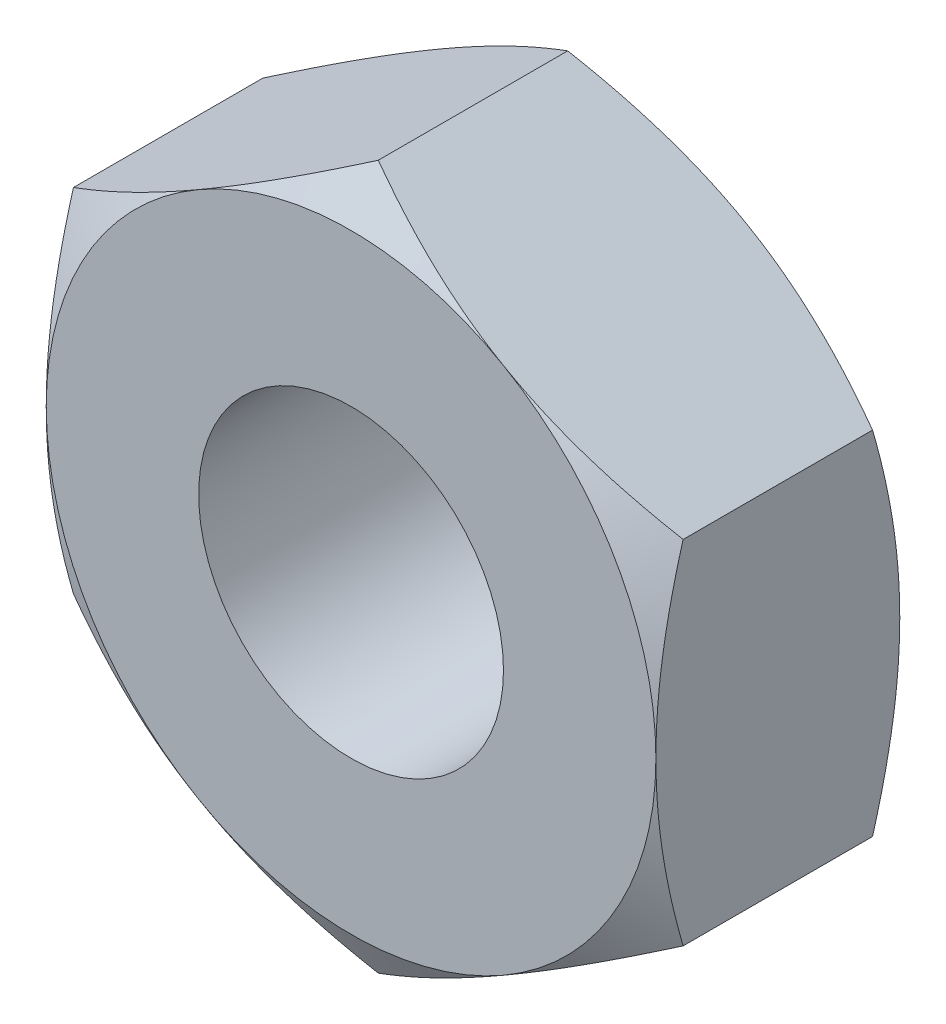
ISO-10303-21;
HEADER;
FILE_DESCRIPTION(('STEP AP214'),'2;1');
FILE_NAME('part.step','',(''),(''),'','','');
FILE_SCHEMA(('AUTOMOTIVE_DESIGN { 1 0 10303 214 1 1 1 1 }'));
ENDSEC;
DATA;
#1=APPLICATION_CONTEXT('core data for automotive mechanical design processes');
#2=APPLICATION_PROTOCOL_DEFINITION('international standard','automotive_design',2000,#1);
#3=PRODUCT_CONTEXT('',#1,'mechanical');
#4=PRODUCT('Part','Part','',(#3));
#5=PRODUCT_RELATED_PRODUCT_CATEGORY('part','',(#4));
#6=PRODUCT_DEFINITION_FORMATION('','',#4);
#7=PRODUCT_DEFINITION_CONTEXT('part definition',#1,'design');
#8=PRODUCT_DEFINITION('design','',#6,#7);
#9=PRODUCT_DEFINITION_SHAPE('','',#8);
#10=(LENGTH_UNIT() NAMED_UNIT(*) SI_UNIT(.MILLI.,.METRE.));
#11=(NAMED_UNIT(*) PLANE_ANGLE_UNIT() SI_UNIT($,.RADIAN.));
#12=(NAMED_UNIT(*) SI_UNIT($,.STERADIAN.) SOLID_ANGLE_UNIT());
#13=UNCERTAINTY_MEASURE_WITH_UNIT(LENGTH_MEASURE(1.E-05),#10,'distance_accuracy_value','');
#14=(GEOMETRIC_REPRESENTATION_CONTEXT(3) GLOBAL_UNCERTAINTY_ASSIGNED_CONTEXT((#13)) GLOBAL_UNIT_ASSIGNED_CONTEXT((#10,
#11,#12)) REPRESENTATION_CONTEXT('',''));
#15=CARTESIAN_POINT('',(0.,0.,0.));
#16=DIRECTION('',(0.,0.,1.));
#17=DIRECTION('',(1.,0.,0.));
#18=AXIS2_PLACEMENT_3D('',#15,#16,#17);
#19=CARTESIAN_POINT('',(0.,0.,-1.));
#20=DIRECTION('',(0.,0.,1.));
#21=DIRECTION('',(1.,0.,0.));
#22=AXIS2_PLACEMENT_3D('',#19,#20,#21);
#23=PLANE('',#22);
#24=CARTESIAN_POINT('',(0.,0.,-1.));
#25=DIRECTION('',(0.,0.,1.));
#26=DIRECTION('',(1.,0.,0.));
#27=AXIS2_PLACEMENT_3D('',#24,#25,#26);
#28=CIRCLE('',#27,1.25);
#29=CARTESIAN_POINT('',(1.25,0.,-1.));
#30=VERTEX_POINT('',#29);
#31=EDGE_CURVE('E250',#30,#30,#28,.T.);
#32=ORIENTED_EDGE('',*,*,#31,.T.);
#33=EDGE_LOOP('',(#32));
#34=FACE_BOUND('',#33,.T.);
#35=CARTESIAN_POINT('',(0.,0.,-1.));
#36=DIRECTION('',(0.,0.,1.));
#37=DIRECTION('',(1.,0.,0.));
#38=AXIS2_PLACEMENT_3D('',#35,#36,#37);
#39=CIRCLE('',#38,2.50000000000001);
#40=CARTESIAN_POINT('',(2.50000000000001,0.,-1.));
#41=VERTEX_POINT('',#40);
#42=CARTESIAN_POINT('',(1.25,2.1650635094611,-1.));
#43=VERTEX_POINT('',#42);
#44=EDGE_CURVE('E138',#41,#43,#39,.T.);
#45=ORIENTED_EDGE('',*,*,#44,.F.);
#46=CARTESIAN_POINT('',(0.,0.,-1.));
#47=DIRECTION('',(0.,0.,1.));
#48=DIRECTION('',(1.,0.,0.));
#49=AXIS2_PLACEMENT_3D('',#46,#47,#48);
#50=CIRCLE('',#49,2.50000000000001);
#51=CARTESIAN_POINT('',(1.25,-2.1650635094611,-1.));
#52=VERTEX_POINT('',#51);
#53=EDGE_CURVE('E12',#41,#52,#50,.F.);
#54=ORIENTED_EDGE('',*,*,#53,.T.);
#55=CARTESIAN_POINT('',(-1.25,-2.1650635094611,-1.));
#56=VERTEX_POINT('',#55);
#57=EDGE_CURVE('E46',#52,#56,#50,.F.);
#58=ORIENTED_EDGE('',*,*,#57,.T.);
#59=CARTESIAN_POINT('',(-2.50000000000001,0.,-1.));
#60=VERTEX_POINT('',#59);
#61=EDGE_CURVE('E427',#56,#60,#50,.F.);
#62=ORIENTED_EDGE('',*,*,#61,.T.);
#63=CARTESIAN_POINT('',(-1.25,2.1650635094611,-1.));
#64=VERTEX_POINT('',#63);
#65=EDGE_CURVE('E146',#60,#64,#50,.F.);
#66=ORIENTED_EDGE('',*,*,#65,.T.);
#67=EDGE_CURVE('E47',#64,#43,#50,.F.);
#68=ORIENTED_EDGE('',*,*,#67,.T.);
#69=EDGE_LOOP('',(#45,#54,#58,#62,#66,#68));
#70=FACE_BOUND('',#69,.T.);
#71=ADVANCED_FACE('F37',(#34,#70),#23,.F.);
#72=CARTESIAN_POINT('',(0.,0.,1.));
#73=DIRECTION('',(0.,0.,1.));
#74=DIRECTION('',(1.,0.,0.));
#75=AXIS2_PLACEMENT_3D('',#72,#73,#74);
#76=PLANE('',#75);
#77=CARTESIAN_POINT('',(0.,0.,1.));
#78=DIRECTION('',(0.,0.,1.));
#79=DIRECTION('',(1.,0.,0.));
#80=AXIS2_PLACEMENT_3D('',#77,#78,#79);
#81=CIRCLE('',#80,1.25);
#82=CARTESIAN_POINT('',(1.25,0.,1.));
#83=VERTEX_POINT('',#82);
#84=EDGE_CURVE('E253',#83,#83,#81,.T.);
#85=ORIENTED_EDGE('',*,*,#84,.F.);
#86=EDGE_LOOP('',(#85));
#87=FACE_BOUND('',#86,.T.);
#88=CARTESIAN_POINT('',(0.,0.,1.));
#89=DIRECTION('',(0.,0.,1.));
#90=DIRECTION('',(1.,0.,0.));
#91=AXIS2_PLACEMENT_3D('',#88,#89,#90);
#92=CIRCLE('',#91,2.50000000000001);
#93=CARTESIAN_POINT('',(1.25,-2.16506350946109,1.));
#94=VERTEX_POINT('',#93);
#95=CARTESIAN_POINT('',(2.49999999999999,0.,1.));
#96=VERTEX_POINT('',#95);
#97=EDGE_CURVE('E152',#94,#96,#92,.T.);
#98=ORIENTED_EDGE('',*,*,#97,.T.);
#99=CARTESIAN_POINT('',(1.25,2.1650635094611,1.));
#100=VERTEX_POINT('',#99);
#101=EDGE_CURVE('E156',#96,#100,#92,.T.);
#102=ORIENTED_EDGE('',*,*,#101,.T.);
#103=CARTESIAN_POINT('',(-1.25,2.1650635094611,1.));
#104=VERTEX_POINT('',#103);
#105=EDGE_CURVE('E301',#100,#104,#92,.T.);
#106=ORIENTED_EDGE('',*,*,#105,.T.);
#107=CARTESIAN_POINT('',(-2.5,0.,1.));
#108=VERTEX_POINT('',#107);
#109=EDGE_CURVE('E305',#104,#108,#92,.T.);
#110=ORIENTED_EDGE('',*,*,#109,.T.);
#111=CARTESIAN_POINT('',(-1.25,-2.16506350946109,1.));
#112=VERTEX_POINT('',#111);
#113=EDGE_CURVE('E307',#108,#112,#92,.T.);
#114=ORIENTED_EDGE('',*,*,#113,.T.);
#115=EDGE_CURVE('E154',#112,#94,#92,.T.);
#116=ORIENTED_EDGE('',*,*,#115,.T.);
#117=EDGE_LOOP('',(#98,#102,#106,#110,#114,#116));
#118=FACE_BOUND('',#117,.T.);
#119=ADVANCED_FACE('F282',(#87,#118),#76,.T.);
#120=CARTESIAN_POINT('',(2.49999999999999,1.44337567297407,1.));
#121=DIRECTION('',(-0.499999999999999,-0.866025403784439,0.));
#122=DIRECTION('',(0.866025403784439,-0.499999999999999,0.));
#123=AXIS2_PLACEMENT_3D('',#120,#121,#122);
#124=PLANE('',#123);
#125=DIRECTION('',(0.,0.,-1.));
#126=VECTOR('',#125,1.);
#127=CARTESIAN_POINT('',(2.49999999999999,1.44337567297407,1.));
#128=LINE('',#127,#126);
#129=CARTESIAN_POINT('',(2.49999999999999,1.44337567297407,0.776709006307406));
#130=VERTEX_POINT('',#129);
#131=CARTESIAN_POINT('',(2.49999999999999,1.44337567297407,-0.776709006307406));
#132=VERTEX_POINT('',#131);
#133=EDGE_CURVE('E151',#130,#132,#128,.T.);
#134=ORIENTED_EDGE('',*,*,#133,.T.);
#135=CARTESIAN_POINT('',(2.50019999999999,1.44326020292023,-0.776642335640899));
#136=CARTESIAN_POINT('',(2.39033676526512,1.50668977106846,-0.813278379892381));
#137=CARTESIAN_POINT('',(2.27952520010347,1.57066685804386,-0.84659778103495));
#138=CARTESIAN_POINT('',(2.05598316653394,1.69972891130042,-0.904757714442148));
#139=CARTESIAN_POINT('',(1.9432487254716,1.7648161711947,-0.929577670852267));
#140=CARTESIAN_POINT('',(1.71917700612472,1.89418403867741,-0.968214348558953));
#141=CARTESIAN_POINT('',(1.60787420823261,1.95844473900197,-0.982288203814366));
#142=CARTESIAN_POINT('',(1.38474477253166,2.08726857876805,-0.999090847647254));
#143=CARTESIAN_POINT('',(1.27291894598576,2.15183124982667,-1.00183354879638));
#144=CARTESIAN_POINT('',(1.06395802444847,2.27247489412634,-0.99613423999195));
#145=CARTESIAN_POINT('',(0.966791682442262,2.3285739078398,-0.989091605618142));
#146=CARTESIAN_POINT('',(0.773092050288991,2.44040644260542,-0.966768580875061));
#147=CARTESIAN_POINT('',(0.676559430340262,2.4961395767184,-0.951480561559736));
#148=CARTESIAN_POINT('',(0.482460278259519,2.60820277442169,-0.913260906155583));
#149=CARTESIAN_POINT('',(0.384918318217855,2.66451865130903,-0.890167223874487));
#150=CARTESIAN_POINT('',(0.191289391923911,2.77631036402774,-0.837753343422091));
#151=CARTESIAN_POINT('',(0.0951999441138209,2.83178763258718,-0.808445464375456));
#152=CARTESIAN_POINT('',(-0.000200000000002555,2.88686681600197,-0.776642335640896));
#153=B_SPLINE_CURVE_WITH_KNOTS('',3,(#135,#136,#137,#138,#139,#140,#141,#142,#143,#144,#145,
#146,#147,#148,#149,#150,#151,#152),.UNSPECIFIED.,.F.,.F.,(4,2,2,2,2,2,2,2,4),(0.,
0.396285827362226,0.793524330152049,1.18093086852114,1.56786160134475,1.90479741793733,
2.24204551660462,2.58677531536755,2.93082800105255),.UNSPECIFIED.);
#154=EDGE_CURVE('E59',#132,#43,#153,.T.);
#155=ORIENTED_EDGE('',*,*,#154,.T.);
#156=CARTESIAN_POINT('',(0.,2.88675134594813,-0.776709006307403));
#157=VERTEX_POINT('',#156);
#158=EDGE_CURVE('E127',#43,#157,#153,.T.);
#159=ORIENTED_EDGE('',*,*,#158,.T.);
#160=DIRECTION('',(0.,0.,-1.));
#161=VECTOR('',#160,1.);
#162=CARTESIAN_POINT('',(0.,2.88675134594813,1.));
#163=LINE('',#162,#161);
#164=CARTESIAN_POINT('',(0.,2.88675134594813,0.776709006307403));
#165=VERTEX_POINT('',#164);
#166=EDGE_CURVE('E269',#165,#157,#163,.T.);
#167=ORIENTED_EDGE('',*,*,#166,.F.);
#168=CARTESIAN_POINT('',(2.50019999999999,1.44326020292023,0.776642335640899));
#169=CARTESIAN_POINT('',(2.39033676526512,1.50668977106846,0.813278379892381));
#170=CARTESIAN_POINT('',(2.27952520010347,1.57066685804386,0.84659778103495));
#171=CARTESIAN_POINT('',(2.05598316653394,1.69972891130042,0.904757714442148));
#172=CARTESIAN_POINT('',(1.9432487254716,1.7648161711947,0.929577670852267));
#173=CARTESIAN_POINT('',(1.71917700612472,1.89418403867741,0.968214348558953));
#174=CARTESIAN_POINT('',(1.60787420823261,1.95844473900197,0.982288203814366));
#175=CARTESIAN_POINT('',(1.38474477253166,2.08726857876805,0.999090847647254));
#176=CARTESIAN_POINT('',(1.27291894598576,2.15183124982667,1.00183354879638));
#177=CARTESIAN_POINT('',(1.06395802444847,2.27247489412634,0.99613423999195));
#178=CARTESIAN_POINT('',(0.966791682442262,2.3285739078398,0.989091605618142));
#179=CARTESIAN_POINT('',(0.773092050288991,2.44040644260542,0.966768580875061));
#180=CARTESIAN_POINT('',(0.676559430340262,2.4961395767184,0.951480561559736));
#181=CARTESIAN_POINT('',(0.482460278259519,2.60820277442169,0.913260906155583));
#182=CARTESIAN_POINT('',(0.384918318217855,2.66451865130903,0.890167223874487));
#183=CARTESIAN_POINT('',(0.191289391923911,2.77631036402774,0.837753343422091));
#184=CARTESIAN_POINT('',(0.0951999441138209,2.83178763258718,0.808445464375456));
#185=CARTESIAN_POINT('',(-0.000200000000002555,2.88686681600197,0.776642335640896));
#186=B_SPLINE_CURVE_WITH_KNOTS('',3,(#168,#169,#170,#171,#172,#173,#174,#175,#176,#177,#178,
#179,#180,#181,#182,#183,#184,#185),.UNSPECIFIED.,.F.,.F.,(4,2,2,2,2,2,2,2,4),(0.,
0.396285827362226,0.793524330152049,1.18093086852114,1.56786160134475,1.90479741793733,
2.24204551660462,2.58677531536755,2.93082800105255),.UNSPECIFIED.);
#187=EDGE_CURVE('E243',#100,#165,#186,.T.);
#188=ORIENTED_EDGE('',*,*,#187,.F.);
#189=EDGE_CURVE('E249',#130,#100,#186,.T.);
#190=ORIENTED_EDGE('',*,*,#189,.F.);
#191=EDGE_LOOP('',(#134,#155,#159,#167,#188,#190));
#192=FACE_BOUND('',#191,.T.);
#193=ADVANCED_FACE('F39',(#192),#124,.F.);
#194=CARTESIAN_POINT('',(0.,2.88675134594813,1.));
#195=DIRECTION('',(0.5,-0.866025403784439,0.));
#196=DIRECTION('',(0.866025403784439,0.5,0.));
#197=AXIS2_PLACEMENT_3D('',#194,#195,#196);
#198=PLANE('',#197);
#199=ORIENTED_EDGE('',*,*,#166,.T.);
#200=CARTESIAN_POINT('',(0.000199999999997342,2.88686681600197,-0.776642335640896));
#201=CARTESIAN_POINT('',(-0.109663234734874,2.82343724785375,-0.813278379892378));
#202=CARTESIAN_POINT('',(-0.220474799896528,2.75946016087834,-0.846597781034948));
#203=CARTESIAN_POINT('',(-0.444016833466053,2.63039810762178,-0.904757714442146));
#204=CARTESIAN_POINT('',(-0.556751274528391,2.5653108477275,-0.929577670852265));
#205=CARTESIAN_POINT('',(-0.780822993875272,2.43594298024479,-0.968214348558951));
#206=CARTESIAN_POINT('',(-0.89212579176738,2.37168227992023,-0.982288203814364));
#207=CARTESIAN_POINT('',(-1.11525522746834,2.24285844015415,-0.999090847647253));
#208=CARTESIAN_POINT('',(-1.22708105401423,2.17829576909553,-1.00183354879638));
#209=CARTESIAN_POINT('',(-1.43604197555152,2.05765212479586,-0.996134239991949));
#210=CARTESIAN_POINT('',(-1.53320831755773,2.0015531110824,-0.989091605618141));
#211=CARTESIAN_POINT('',(-1.72690794971101,1.88972057631678,-0.96676858087506));
#212=CARTESIAN_POINT('',(-1.82344056965974,1.8339874422038,-0.951480561559735));
#213=CARTESIAN_POINT('',(-2.01753972174048,1.7219242445005,-0.913260906155582));
#214=CARTESIAN_POINT('',(-2.11508168178214,1.66560836761316,-0.890167223874485));
#215=CARTESIAN_POINT('',(-2.30871060807609,1.55381665489446,-0.837753343422089));
#216=CARTESIAN_POINT('',(-2.40480005588618,1.49833938633502,-0.808445464375454));
#217=CARTESIAN_POINT('',(-2.5002,1.44326020292023,-0.776642335640894));
#218=B_SPLINE_CURVE_WITH_KNOTS('',3,(#200,#201,#202,#203,#204,#205,#206,#207,#208,#209,#210,
#211,#212,#213,#214,#215,#216,#217),.UNSPECIFIED.,.F.,.F.,(4,2,2,2,2,2,2,2,4),(0.,
0.396285827362227,0.793524330152051,1.18093086852114,1.56786160134475,1.90479741793733,
2.24204551660463,2.58677531536756,2.93082800105256),.UNSPECIFIED.);
#219=EDGE_CURVE('E132',#157,#64,#218,.T.);
#220=ORIENTED_EDGE('',*,*,#219,.T.);
#221=CARTESIAN_POINT('',(-2.5,1.44337567297407,-0.776709006307401));
#222=VERTEX_POINT('',#221);
#223=EDGE_CURVE('E163',#64,#222,#218,.T.);
#224=ORIENTED_EDGE('',*,*,#223,.T.);
#225=DIRECTION('',(0.,0.,-1.));
#226=VECTOR('',#225,1.);
#227=CARTESIAN_POINT('',(-2.5,1.44337567297407,1.));
#228=LINE('',#227,#226);
#229=CARTESIAN_POINT('',(-2.5,1.44337567297407,0.776709006307401));
#230=VERTEX_POINT('',#229);
#231=EDGE_CURVE('E266',#230,#222,#228,.T.);
#232=ORIENTED_EDGE('',*,*,#231,.F.);
#233=CARTESIAN_POINT('',(0.000199999999997342,2.88686681600197,0.776642335640896));
#234=CARTESIAN_POINT('',(-0.109663234734874,2.82343724785375,0.813278379892378));
#235=CARTESIAN_POINT('',(-0.220474799896528,2.75946016087834,0.846597781034948));
#236=CARTESIAN_POINT('',(-0.444016833466053,2.63039810762178,0.904757714442146));
#237=CARTESIAN_POINT('',(-0.556751274528391,2.5653108477275,0.929577670852265));
#238=CARTESIAN_POINT('',(-0.780822993875272,2.43594298024479,0.968214348558951));
#239=CARTESIAN_POINT('',(-0.89212579176738,2.37168227992023,0.982288203814364));
#240=CARTESIAN_POINT('',(-1.11525522746834,2.24285844015415,0.999090847647253));
#241=CARTESIAN_POINT('',(-1.22708105401423,2.17829576909553,1.00183354879638));
#242=CARTESIAN_POINT('',(-1.43604197555152,2.05765212479586,0.996134239991949));
#243=CARTESIAN_POINT('',(-1.53320831755773,2.0015531110824,0.989091605618141));
#244=CARTESIAN_POINT('',(-1.72690794971101,1.88972057631678,0.96676858087506));
#245=CARTESIAN_POINT('',(-1.82344056965974,1.8339874422038,0.951480561559735));
#246=CARTESIAN_POINT('',(-2.01753972174048,1.7219242445005,0.913260906155582));
#247=CARTESIAN_POINT('',(-2.11508168178214,1.66560836761316,0.890167223874485));
#248=CARTESIAN_POINT('',(-2.30871060807609,1.55381665489446,0.837753343422089));
#249=CARTESIAN_POINT('',(-2.40480005588618,1.49833938633502,0.808445464375454));
#250=CARTESIAN_POINT('',(-2.5002,1.44326020292023,0.776642335640894));
#251=B_SPLINE_CURVE_WITH_KNOTS('',3,(#233,#234,#235,#236,#237,#238,#239,#240,#241,#242,#243,
#244,#245,#246,#247,#248,#249,#250),.UNSPECIFIED.,.F.,.F.,(4,2,2,2,2,2,2,2,4),(0.,
0.396285827362227,0.793524330152051,1.18093086852114,1.56786160134475,1.90479741793733,
2.24204551660463,2.58677531536756,2.93082800105256),.UNSPECIFIED.);
#252=EDGE_CURVE('E236',#104,#230,#251,.T.);
#253=ORIENTED_EDGE('',*,*,#252,.F.);
#254=EDGE_CURVE('E242',#165,#104,#251,.T.);
#255=ORIENTED_EDGE('',*,*,#254,.F.);
#256=EDGE_LOOP('',(#199,#220,#224,#232,#253,#255));
#257=FACE_BOUND('',#256,.T.);
#258=ADVANCED_FACE('F216',(#257),#198,.F.);
#259=CARTESIAN_POINT('',(-2.5,1.44337567297407,1.));
#260=DIRECTION('',(1.,0.,0.));
#261=DIRECTION('',(0.,1.,0.));
#262=AXIS2_PLACEMENT_3D('',#259,#260,#261);
#263=PLANE('',#262);
#264=ORIENTED_EDGE('',*,*,#231,.T.);
#265=CARTESIAN_POINT('',(-2.5,-3.93425573350289,0.247867421248394));
#266=CARTESIAN_POINT('',(-2.5,-3.82455805059036,0.194426831841063));
#267=CARTESIAN_POINT('',(-2.5,-3.71461457919922,0.141482424098895));
#268=CARTESIAN_POINT('',(-2.5,-3.49410553611727,0.0368639808984596));
#269=CARTESIAN_POINT('',(-2.5,-3.38353987453968,-0.0148098648960192));
#270=CARTESIAN_POINT('',(-2.5,-3.16111337045581,-0.116856970846164));
#271=CARTESIAN_POINT('',(-2.5,-3.04924878505129,-0.167222100016645));
#272=CARTESIAN_POINT('',(-2.5,-2.82464950600592,-0.265965836196234));
#273=CARTESIAN_POINT('',(-2.5,-2.71191485216742,-0.314344533444713));
#274=CARTESIAN_POINT('',(-2.5,-2.48157262776063,-0.41018365290727));
#275=CARTESIAN_POINT('',(-2.5,-2.36392902979747,-0.457557943768869));
#276=CARTESIAN_POINT('',(-2.5,-2.12728680576953,-0.548857519780596));
#277=CARTESIAN_POINT('',(-2.5,-2.0082880325045,-0.592782426084272));
#278=CARTESIAN_POINT('',(-2.5,-1.7689508623124,-0.676072033695631));
#279=CARTESIAN_POINT('',(-2.5,-1.64861554080834,-0.715445486315183));
#280=CARTESIAN_POINT('',(-2.5,-1.4062196480392,-0.788406805742603));
#281=CARTESIAN_POINT('',(-2.5,-1.28415961458997,-0.821996434838304));
#282=CARTESIAN_POINT('',(-2.5,-1.03891951871328,-0.881638195313747));
#283=CARTESIAN_POINT('',(-2.5,-0.915749874717236,-0.90773239405876));
#284=CARTESIAN_POINT('',(-2.5,-0.667820858353002,-0.950944962578456));
#285=CARTESIAN_POINT('',(-2.5,-0.543061659704268,-0.9680643047244));
#286=CARTESIAN_POINT('',(-2.5,-0.294229287436146,-0.991740236915555));
#287=CARTESIAN_POINT('',(-2.5,-0.170169796975897,-0.998437081166277));
#288=CARTESIAN_POINT('',(-2.5,0.0780766721177555,-1.00107330127473));
#289=CARTESIAN_POINT('',(-2.5,0.20226365266606,-0.997012513118002));
#290=CARTESIAN_POINT('',(-2.5,0.411409603386496,-0.98140726696173));
#291=CARTESIAN_POINT('',(-2.5,0.49658467012454,-0.972575692039977));
#292=CARTESIAN_POINT('',(-2.5,0.666344729519183,-0.950371522415863));
#293=CARTESIAN_POINT('',(-2.5,0.750929646942494,-0.936998359161175));
#294=CARTESIAN_POINT('',(-2.5,1.00366547850548,-0.89076597166978));
#295=CARTESIAN_POINT('',(-2.5,1.17071375389144,-0.851800955950568));
#296=CARTESIAN_POINT('',(-2.5,1.4206286497043,-0.783796481710404));
#297=CARTESIAN_POINT('',(-2.5,1.50477790033849,-0.759198505927022));
#298=CARTESIAN_POINT('',(-2.5,1.67225987739084,-0.707339930418387));
#299=CARTESIAN_POINT('',(-2.5,1.75559259753029,-0.680079310236354));
#300=CARTESIAN_POINT('',(-2.5,1.9214668169918,-0.62334183850765));
#301=CARTESIAN_POINT('',(-2.5,2.00400853301611,-0.593865614720603));
#302=CARTESIAN_POINT('',(-2.5,2.16840002168345,-0.533054478519506));
#303=CARTESIAN_POINT('',(-2.5,2.25024980997479,-0.501719608268913));
#304=CARTESIAN_POINT('',(-2.5,2.47007598174685,-0.415156402748032));
#305=CARTESIAN_POINT('',(-2.5,2.60747896056648,-0.35847329125268));
#306=CARTESIAN_POINT('',(-2.5,2.88087320612347,-0.241787279064343));
#307=CARTESIAN_POINT('',(-2.5,3.01686431559251,-0.181784013152345));
#308=CARTESIAN_POINT('',(-2.5,3.28775370835403,-0.0592449840030359));
#309=CARTESIAN_POINT('',(-2.50000000000001,3.42265159686246,0.00329164910482739));
#310=CARTESIAN_POINT('',(-2.50000000000001,3.69153349422199,0.130303258328515));
#311=CARTESIAN_POINT('',(-2.50000000000001,3.82551747498239,0.194778293698389));
#312=CARTESIAN_POINT('',(-2.50000000000001,4.22678780126195,0.39065285496258));
#313=CARTESIAN_POINT('',(-2.50000000000001,4.49297167318085,0.524307966533661));
#314=CARTESIAN_POINT('',(-2.50000000000001,5.02332786921172,0.795387790277856));
#315=CARTESIAN_POINT('',(-2.50000000000001,5.28750060022439,0.932811712561521));
#316=CARTESIAN_POINT('',(-2.50000000000001,5.78669440868187,1.19560284648368));
#317=CARTESIAN_POINT('',(-2.50000000000001,6.02185115681081,1.32071278415739));
#318=CARTESIAN_POINT('',(-2.50000000000001,6.49137306451876,1.57244119096535));
#319=CARTESIAN_POINT('',(-2.50000000000001,6.72573817462958,1.69905975221195));
#320=CARTESIAN_POINT('',(-2.50000000000001,7.19307671922481,1.95299069369911));
#321=CARTESIAN_POINT('',(-2.50000000000001,7.42605218661544,2.08029933697469));
#322=CARTESIAN_POINT('',(-2.50000000000001,7.8915086293687,2.33577450313903));
#323=CARTESIAN_POINT('',(-2.50000000000001,8.12398964218729,2.46394095775789));
#324=CARTESIAN_POINT('',(-2.50000000000001,8.35629687655467,2.59241944759748));
#325=B_SPLINE_CURVE_WITH_KNOTS('',3,(#265,#266,#267,#268,#269,#270,#271,#272,#273,#274,#275,
#276,#277,#278,#279,#280,#281,#282,#283,#284,#285,#286,#287,#288,#289,#290,#291,#292,#293,#294,
#295,#296,#297,#298,#299,#300,#301,#302,#303,#304,#305,#306,#307,#308,#309,#310,#311,#312,#313,
#314,#315,#316,#317,#318,#319,#320,#321,#322,#323,#324),.UNSPECIFIED.,.F.,.F.,(4,2,2,2,2,2,2,2,
2,2,2,2,2,2,2,2,2,2,2,2,2,2,2,2,2,2,2,2,2,4),(0.,0.366071555698272,0.732197429176889,
1.10022131388628,1.46822846151579,1.84865877125671,2.22913080545098,2.60885867061217,
2.98847063000568,3.36590845584489,3.74330538013014,4.11557840831441,4.48785711233042,
4.74462879039507,5.00143262504743,5.51529119875922,5.77827949353832,6.04126980898419,
6.30418588874309,6.56709600652125,7.0129377385577,7.45882861133188,7.90487390731068,
8.3509328521168,9.24444045956447,10.1377622104064,10.9368546386539,11.7359961098642,
12.5324647628885,13.3288707644253),.UNSPECIFIED.);
#326=EDGE_CURVE('E210',#222,#60,#325,.F.);
#327=ORIENTED_EDGE('',*,*,#326,.T.);
#328=CARTESIAN_POINT('',(-2.5,-1.44337567297405,-0.776709006307406));
#329=VERTEX_POINT('',#328);
#330=EDGE_CURVE('E203',#60,#329,#325,.F.);
#331=ORIENTED_EDGE('',*,*,#330,.T.);
#332=DIRECTION('',(0.,0.,-1.));
#333=VECTOR('',#332,1.);
#334=CARTESIAN_POINT('',(-2.5,-1.44337567297405,1.));
#335=LINE('',#334,#333);
#336=CARTESIAN_POINT('',(-2.5,-1.44337567297405,0.776709006307406));
#337=VERTEX_POINT('',#336);
#338=EDGE_CURVE('E263',#337,#329,#335,.T.);
#339=ORIENTED_EDGE('',*,*,#338,.F.);
#340=CARTESIAN_POINT('',(-2.5,-3.93425573350289,-0.247867421248394));
#341=CARTESIAN_POINT('',(-2.5,-3.82455805059036,-0.194426831841063));
#342=CARTESIAN_POINT('',(-2.5,-3.71461457919922,-0.141482424098895));
#343=CARTESIAN_POINT('',(-2.5,-3.49410553611727,-0.0368639808984596));
#344=CARTESIAN_POINT('',(-2.5,-3.38353987453968,0.0148098648960192));
#345=CARTESIAN_POINT('',(-2.5,-3.16111337045581,0.116856970846164));
#346=CARTESIAN_POINT('',(-2.5,-3.04924878505129,0.167222100016645));
#347=CARTESIAN_POINT('',(-2.5,-2.82464950600592,0.265965836196234));
#348=CARTESIAN_POINT('',(-2.5,-2.71191485216742,0.314344533444713));
#349=CARTESIAN_POINT('',(-2.5,-2.48157262776063,0.41018365290727));
#350=CARTESIAN_POINT('',(-2.5,-2.36392902979747,0.457557943768869));
#351=CARTESIAN_POINT('',(-2.5,-2.12728680576953,0.548857519780596));
#352=CARTESIAN_POINT('',(-2.5,-2.0082880325045,0.592782426084272));
#353=CARTESIAN_POINT('',(-2.5,-1.7689508623124,0.676072033695631));
#354=CARTESIAN_POINT('',(-2.5,-1.64861554080834,0.715445486315183));
#355=CARTESIAN_POINT('',(-2.5,-1.4062196480392,0.788406805742603));
#356=CARTESIAN_POINT('',(-2.5,-1.28415961458997,0.821996434838304));
#357=CARTESIAN_POINT('',(-2.5,-1.03891951871328,0.881638195313747));
#358=CARTESIAN_POINT('',(-2.5,-0.915749874717236,0.90773239405876));
#359=CARTESIAN_POINT('',(-2.5,-0.667820858353002,0.950944962578456));
#360=CARTESIAN_POINT('',(-2.5,-0.543061659704268,0.9680643047244));
#361=CARTESIAN_POINT('',(-2.5,-0.294229287436146,0.991740236915555));
#362=CARTESIAN_POINT('',(-2.5,-0.170169796975897,0.998437081166277));
#363=CARTESIAN_POINT('',(-2.5,0.0780766721177555,1.00107330127473));
#364=CARTESIAN_POINT('',(-2.5,0.20226365266606,0.997012513118002));
#365=CARTESIAN_POINT('',(-2.5,0.411409603386496,0.98140726696173));
#366=CARTESIAN_POINT('',(-2.5,0.49658467012454,0.972575692039977));
#367=CARTESIAN_POINT('',(-2.5,0.666344729519183,0.950371522415863));
#368=CARTESIAN_POINT('',(-2.5,0.750929646942494,0.936998359161175));
#369=CARTESIAN_POINT('',(-2.5,1.00366547850548,0.89076597166978));
#370=CARTESIAN_POINT('',(-2.5,1.17071375389144,0.851800955950568));
#371=CARTESIAN_POINT('',(-2.5,1.4206286497043,0.783796481710404));
#372=CARTESIAN_POINT('',(-2.5,1.50477790033849,0.759198505927022));
#373=CARTESIAN_POINT('',(-2.5,1.67225987739084,0.707339930418387));
#374=CARTESIAN_POINT('',(-2.5,1.75559259753029,0.680079310236354));
#375=CARTESIAN_POINT('',(-2.5,1.9214668169918,0.62334183850765));
#376=CARTESIAN_POINT('',(-2.5,2.00400853301611,0.593865614720603));
#377=CARTESIAN_POINT('',(-2.5,2.16840002168345,0.533054478519506));
#378=CARTESIAN_POINT('',(-2.5,2.25024980997479,0.501719608268913));
#379=CARTESIAN_POINT('',(-2.5,2.47007598174685,0.415156402748032));
#380=CARTESIAN_POINT('',(-2.5,2.60747896056648,0.35847329125268));
#381=CARTESIAN_POINT('',(-2.5,2.88087320612347,0.241787279064343));
#382=CARTESIAN_POINT('',(-2.5,3.01686431559251,0.181784013152345));
#383=CARTESIAN_POINT('',(-2.5,3.28775370835403,0.0592449840030359));
#384=CARTESIAN_POINT('',(-2.50000000000001,3.42265159686246,-0.00329164910482739));
#385=CARTESIAN_POINT('',(-2.50000000000001,3.69153349422199,-0.130303258328515));
#386=CARTESIAN_POINT('',(-2.50000000000001,3.82551747498239,-0.194778293698389));
#387=CARTESIAN_POINT('',(-2.50000000000001,4.22678780126195,-0.39065285496258));
#388=CARTESIAN_POINT('',(-2.50000000000001,4.49297167318085,-0.524307966533661));
#389=CARTESIAN_POINT('',(-2.50000000000001,5.02332786921172,-0.795387790277856));
#390=CARTESIAN_POINT('',(-2.50000000000001,5.28750060022439,-0.932811712561521));
#391=CARTESIAN_POINT('',(-2.50000000000001,5.78669440868187,-1.19560284648368));
#392=CARTESIAN_POINT('',(-2.50000000000001,6.02185115681081,-1.32071278415739));
#393=CARTESIAN_POINT('',(-2.50000000000001,6.49137306451876,-1.57244119096535));
#394=CARTESIAN_POINT('',(-2.50000000000001,6.72573817462958,-1.69905975221195));
#395=CARTESIAN_POINT('',(-2.50000000000001,7.19307671922481,-1.95299069369911));
#396=CARTESIAN_POINT('',(-2.50000000000001,7.42605218661544,-2.08029933697469));
#397=CARTESIAN_POINT('',(-2.50000000000001,7.8915086293687,-2.33577450313903));
#398=CARTESIAN_POINT('',(-2.50000000000001,8.12398964218729,-2.46394095775789));
#399=CARTESIAN_POINT('',(-2.50000000000001,8.35629687655467,-2.59241944759748));
#400=B_SPLINE_CURVE_WITH_KNOTS('',3,(#340,#341,#342,#343,#344,#345,#346,#347,#348,#349,#350,
#351,#352,#353,#354,#355,#356,#357,#358,#359,#360,#361,#362,#363,#364,#365,#366,#367,#368,#369,
#370,#371,#372,#373,#374,#375,#376,#377,#378,#379,#380,#381,#382,#383,#384,#385,#386,#387,#388,
#389,#390,#391,#392,#393,#394,#395,#396,#397,#398,#399),.UNSPECIFIED.,.F.,.F.,(4,2,2,2,2,2,2,2,
2,2,2,2,2,2,2,2,2,2,2,2,2,2,2,2,2,2,2,2,2,4),(0.,0.366071555698272,0.732197429176889,
1.10022131388628,1.46822846151579,1.84865877125671,2.22913080545098,2.60885867061217,
2.98847063000568,3.36590845584489,3.74330538013014,4.11557840831441,4.48785711233042,
4.74462879039507,5.00143262504743,5.51529119875922,5.77827949353832,6.04126980898419,
6.30418588874309,6.56709600652125,7.0129377385577,7.45882861133188,7.90487390731068,
8.3509328521168,9.24444045956447,10.1377622104064,10.9368546386539,11.7359961098642,
12.5324647628885,13.3288707644253),.UNSPECIFIED.);
#401=EDGE_CURVE('E222',#108,#337,#400,.F.);
#402=ORIENTED_EDGE('',*,*,#401,.F.);
#403=EDGE_CURVE('E229',#230,#108,#400,.F.);
#404=ORIENTED_EDGE('',*,*,#403,.F.);
#405=EDGE_LOOP('',(#264,#327,#331,#339,#402,#404));
#406=FACE_BOUND('',#405,.T.);
#407=ADVANCED_FACE('F212',(#406),#263,.F.);
#408=CARTESIAN_POINT('',(-2.5,-1.44337567297405,1.));
#409=DIRECTION('',(0.5,0.866025403784439,0.));
#410=DIRECTION('',(-0.866025403784439,0.5,0.));
#411=AXIS2_PLACEMENT_3D('',#408,#409,#410);
#412=PLANE('',#411);
#413=ORIENTED_EDGE('',*,*,#338,.T.);
#414=CARTESIAN_POINT('',(-2.5002,-1.44326020292021,-0.776642335640899));
#415=CARTESIAN_POINT('',(-2.39033676526513,-1.50668977106843,-0.813278379892381));
#416=CARTESIAN_POINT('',(-2.27952520010348,-1.57066685804384,-0.846597781034951));
#417=CARTESIAN_POINT('',(-2.05598316653395,-1.6997289113004,-0.90475771444215));
#418=CARTESIAN_POINT('',(-1.94324872547162,-1.76481617119468,-0.92957767085227));
#419=CARTESIAN_POINT('',(-1.71917700612474,-1.89418403867739,-0.968214348558957));
#420=CARTESIAN_POINT('',(-1.60787420823263,-1.95844473900195,-0.98228820381437));
#421=CARTESIAN_POINT('',(-1.38474477253167,-2.08726857876803,-0.999090847647259));
#422=CARTESIAN_POINT('',(-1.27291894598578,-2.15183124982665,-1.00183354879638));
#423=CARTESIAN_POINT('',(-1.06395802444848,-2.27247489412632,-0.996134239991957));
#424=CARTESIAN_POINT('',(-0.966791682442273,-2.32857390783978,-0.989091605618149));
#425=CARTESIAN_POINT('',(-0.773092050289001,-2.4404064426054,-0.966768580875068));
#426=CARTESIAN_POINT('',(-0.67655943034027,-2.49613957671838,-0.951480561559744));
#427=CARTESIAN_POINT('',(-0.482460278259525,-2.60820277442168,-0.913260906155591));
#428=CARTESIAN_POINT('',(-0.384918318217861,-2.66451865130902,-0.890167223874494));
#429=CARTESIAN_POINT('',(-0.191289391923915,-2.77631036402773,-0.837753343422098));
#430=CARTESIAN_POINT('',(-0.0951999441138235,-2.83178763258716,-0.808445464375462));
#431=CARTESIAN_POINT('',(0.000200000000000936,-2.88686681600196,-0.776642335640902));
#432=B_SPLINE_CURVE_WITH_KNOTS('',3,(#414,#415,#416,#417,#418,#419,#420,#421,#422,#423,#424,
#425,#426,#427,#428,#429,#430,#431),.UNSPECIFIED.,.F.,.F.,(4,2,2,2,2,2,2,2,4),(0.,
0.396285827362226,0.79352433015205,1.18093086852114,1.56786160134475,1.90479741793733,
2.24204551660463,2.58677531536756,2.93082800105257),.UNSPECIFIED.);
#433=EDGE_CURVE('E211',#329,#56,#432,.T.);
#434=ORIENTED_EDGE('',*,*,#433,.T.);
#435=CARTESIAN_POINT('',(0.,-2.88675134594812,-0.776709006307409));
#436=VERTEX_POINT('',#435);
#437=EDGE_CURVE('E197',#56,#436,#432,.T.);
#438=ORIENTED_EDGE('',*,*,#437,.T.);
#439=DIRECTION('',(0.,0.,-1.));
#440=VECTOR('',#439,1.);
#441=CARTESIAN_POINT('',(0.,-2.88675134594812,1.));
#442=LINE('',#441,#440);
#443=CARTESIAN_POINT('',(0.,-2.88675134594812,0.776709006307409));
#444=VERTEX_POINT('',#443);
#445=EDGE_CURVE('E260',#444,#436,#442,.T.);
#446=ORIENTED_EDGE('',*,*,#445,.F.);
#447=CARTESIAN_POINT('',(-2.5002,-1.44326020292021,0.776642335640899));
#448=CARTESIAN_POINT('',(-2.39033676526513,-1.50668977106843,0.813278379892381));
#449=CARTESIAN_POINT('',(-2.27952520010348,-1.57066685804384,0.846597781034951));
#450=CARTESIAN_POINT('',(-2.05598316653395,-1.6997289113004,0.90475771444215));
#451=CARTESIAN_POINT('',(-1.94324872547162,-1.76481617119468,0.92957767085227));
#452=CARTESIAN_POINT('',(-1.71917700612474,-1.89418403867739,0.968214348558957));
#453=CARTESIAN_POINT('',(-1.60787420823263,-1.95844473900195,0.98228820381437));
#454=CARTESIAN_POINT('',(-1.38474477253167,-2.08726857876803,0.999090847647259));
#455=CARTESIAN_POINT('',(-1.27291894598578,-2.15183124982665,1.00183354879638));
#456=CARTESIAN_POINT('',(-1.06395802444848,-2.27247489412632,0.996134239991957));
#457=CARTESIAN_POINT('',(-0.966791682442273,-2.32857390783978,0.989091605618149));
#458=CARTESIAN_POINT('',(-0.773092050289001,-2.4404064426054,0.966768580875068));
#459=CARTESIAN_POINT('',(-0.67655943034027,-2.49613957671838,0.951480561559744));
#460=CARTESIAN_POINT('',(-0.482460278259525,-2.60820277442168,0.913260906155591));
#461=CARTESIAN_POINT('',(-0.384918318217861,-2.66451865130902,0.890167223874494));
#462=CARTESIAN_POINT('',(-0.191289391923915,-2.77631036402773,0.837753343422098));
#463=CARTESIAN_POINT('',(-0.0951999441138235,-2.83178763258716,0.808445464375462));
#464=CARTESIAN_POINT('',(0.000200000000000936,-2.88686681600196,0.776642335640902));
#465=B_SPLINE_CURVE_WITH_KNOTS('',3,(#447,#448,#449,#450,#451,#452,#453,#454,#455,#456,#457,
#458,#459,#460,#461,#462,#463,#464),.UNSPECIFIED.,.F.,.F.,(4,2,2,2,2,2,2,2,4),(0.,
0.396285827362226,0.79352433015205,1.18093086852114,1.56786160134475,1.90479741793733,
2.24204551660463,2.58677531536756,2.93082800105257),.UNSPECIFIED.);
#466=EDGE_CURVE('E231',#112,#444,#465,.T.);
#467=ORIENTED_EDGE('',*,*,#466,.F.);
#468=EDGE_CURVE('E230',#337,#112,#465,.T.);
#469=ORIENTED_EDGE('',*,*,#468,.F.);
#470=EDGE_LOOP('',(#413,#434,#438,#446,#467,#469));
#471=FACE_BOUND('',#470,.T.);
#472=ADVANCED_FACE('F215',(#471),#412,.F.);
#473=CARTESIAN_POINT('',(0.,-2.88675134594812,1.));
#474=DIRECTION('',(-0.5,0.866025403784438,0.));
#475=DIRECTION('',(-0.866025403784438,-0.5,0.));
#476=AXIS2_PLACEMENT_3D('',#473,#474,#475);
#477=PLANE('',#476);
#478=ORIENTED_EDGE('',*,*,#445,.T.);
#479=CARTESIAN_POINT('',(-0.000199999999998766,-2.88686681600196,-0.776642335640902));
#480=CARTESIAN_POINT('',(0.109663234734872,-2.82343724785374,-0.813278379892384));
#481=CARTESIAN_POINT('',(0.220474799896526,-2.75946016087833,-0.846597781034954));
#482=CARTESIAN_POINT('',(0.444016833466049,-2.63039810762177,-0.904757714442152));
#483=CARTESIAN_POINT('',(0.556751274528387,-2.56531084772749,-0.929577670852271));
#484=CARTESIAN_POINT('',(0.780822993875267,-2.43594298024478,-0.968214348558957));
#485=CARTESIAN_POINT('',(0.892125791767375,-2.37168227992022,-0.98228820381437));
#486=CARTESIAN_POINT('',(1.11525522746833,-2.24285844015414,-0.999090847647259));
#487=CARTESIAN_POINT('',(1.22708105401422,-2.17829576909552,-1.00183354879638));
#488=CARTESIAN_POINT('',(1.43604197555152,-2.05765212479585,-0.996134239991956));
#489=CARTESIAN_POINT('',(1.53320831755773,-2.00155311108239,-0.989091605618148));
#490=CARTESIAN_POINT('',(1.726907949711,-1.88972057631677,-0.966768580875067));
#491=CARTESIAN_POINT('',(1.82344056965973,-1.83398744220379,-0.951480561559742));
#492=CARTESIAN_POINT('',(2.01753972174047,-1.7219242445005,-0.913260906155589));
#493=CARTESIAN_POINT('',(2.11508168178213,-1.66560836761316,-0.890167223874493));
#494=CARTESIAN_POINT('',(2.30871060807608,-1.55381665489445,-0.837753343422097));
#495=CARTESIAN_POINT('',(2.40480005588617,-1.49833938633501,-0.808445464375462));
#496=CARTESIAN_POINT('',(2.50019999999999,-1.44326020292022,-0.776642335640902));
#497=B_SPLINE_CURVE_WITH_KNOTS('',3,(#479,#480,#481,#482,#483,#484,#485,#486,#487,#488,#489,
#490,#491,#492,#493,#494,#495,#496),.UNSPECIFIED.,.F.,.F.,(4,2,2,2,2,2,2,2,4),(0.,
0.396285827362225,0.793524330152048,1.18093086852114,1.56786160134475,1.90479741793732,
2.24204551660462,2.58677531536755,2.93082800105255),.UNSPECIFIED.);
#498=EDGE_CURVE('E327',#436,#52,#497,.T.);
#499=ORIENTED_EDGE('',*,*,#498,.T.);
#500=CARTESIAN_POINT('',(2.49999999999999,-1.44337567297418,-0.77670900630749));
#501=VERTEX_POINT('',#500);
#502=EDGE_CURVE('E190',#52,#501,#497,.T.);
#503=ORIENTED_EDGE('',*,*,#502,.T.);
#504=DIRECTION('',(0.,0.,-1.));
#505=VECTOR('',#504,1.);
#506=CARTESIAN_POINT('',(2.49999999999999,-1.44337567297406,1.));
#507=LINE('',#506,#505);
#508=CARTESIAN_POINT('',(2.49999999999999,-1.44337567297418,0.77670900630749));
#509=VERTEX_POINT('',#508);
#510=EDGE_CURVE('E257',#509,#501,#507,.T.);
#511=ORIENTED_EDGE('',*,*,#510,.F.);
#512=CARTESIAN_POINT('',(-0.000199999999998766,-2.88686681600196,0.776642335640902));
#513=CARTESIAN_POINT('',(0.109663234734872,-2.82343724785374,0.813278379892384));
#514=CARTESIAN_POINT('',(0.220474799896526,-2.75946016087833,0.846597781034954));
#515=CARTESIAN_POINT('',(0.444016833466049,-2.63039810762177,0.904757714442152));
#516=CARTESIAN_POINT('',(0.556751274528387,-2.56531084772749,0.929577670852271));
#517=CARTESIAN_POINT('',(0.780822993875267,-2.43594298024478,0.968214348558957));
#518=CARTESIAN_POINT('',(0.892125791767375,-2.37168227992022,0.98228820381437));
#519=CARTESIAN_POINT('',(1.11525522746833,-2.24285844015414,0.999090847647259));
#520=CARTESIAN_POINT('',(1.22708105401422,-2.17829576909552,1.00183354879638));
#521=CARTESIAN_POINT('',(1.43604197555152,-2.05765212479585,0.996134239991956));
#522=CARTESIAN_POINT('',(1.53320831755773,-2.00155311108239,0.989091605618148));
#523=CARTESIAN_POINT('',(1.726907949711,-1.88972057631677,0.966768580875067));
#524=CARTESIAN_POINT('',(1.82344056965973,-1.83398744220379,0.951480561559742));
#525=CARTESIAN_POINT('',(2.01753972174047,-1.7219242445005,0.913260906155589));
#526=CARTESIAN_POINT('',(2.11508168178213,-1.66560836761316,0.890167223874493));
#527=CARTESIAN_POINT('',(2.30871060807608,-1.55381665489445,0.837753343422097));
#528=CARTESIAN_POINT('',(2.40480005588617,-1.49833938633501,0.808445464375462));
#529=CARTESIAN_POINT('',(2.50019999999999,-1.44326020292022,0.776642335640902));
#530=B_SPLINE_CURVE_WITH_KNOTS('',3,(#512,#513,#514,#515,#516,#517,#518,#519,#520,#521,#522,
#523,#524,#525,#526,#527,#528,#529),.UNSPECIFIED.,.F.,.F.,(4,2,2,2,2,2,2,2,4),(0.,
0.396285827362225,0.793524330152048,1.18093086852114,1.56786160134475,1.90479741793732,
2.24204551660462,2.58677531536755,2.93082800105255),.UNSPECIFIED.);
#531=EDGE_CURVE('E289',#94,#509,#530,.T.);
#532=ORIENTED_EDGE('',*,*,#531,.F.);
#533=EDGE_CURVE('E294',#444,#94,#530,.T.);
#534=ORIENTED_EDGE('',*,*,#533,.F.);
#535=EDGE_LOOP('',(#478,#499,#503,#511,#532,#534));
#536=FACE_BOUND('',#535,.T.);
#537=ADVANCED_FACE('F280',(#536),#477,.F.);
#538=CARTESIAN_POINT('',(2.49999999999999,-1.44337567297406,1.));
#539=DIRECTION('',(-1.,0.,0.));
#540=DIRECTION('',(0.,-1.,0.));
#541=AXIS2_PLACEMENT_3D('',#538,#539,#540);
#542=PLANE('',#541);
#543=ORIENTED_EDGE('',*,*,#510,.T.);
#544=CARTESIAN_POINT('',(2.49999999999999,-3.93425573570175,0.247867422319876));
#545=CARTESIAN_POINT('',(2.49999999999999,-3.82455805271519,0.194426832867892));
#546=CARTESIAN_POINT('',(2.49999999999999,-3.71461458124996,0.141482425081095));
#547=CARTESIAN_POINT('',(2.49999999999999,-3.49410553801962,0.0368639817916177));
#548=CARTESIAN_POINT('',(2.49999999999999,-3.38353987636771,-0.0148098640472745));
#549=CARTESIAN_POINT('',(2.49999999999999,-3.16111337213411,-0.116856970086268));
#550=CARTESIAN_POINT('',(2.49999999999999,-3.04924878665416,-0.167222099301176));
#551=CARTESIAN_POINT('',(2.49999999999999,-2.82464950745741,-0.265965835568889));
#552=CARTESIAN_POINT('',(2.49999999999999,-2.71191485354297,-0.314344532861064));
#553=CARTESIAN_POINT('',(2.49999999999999,-2.48157262897831,-0.410183652412344));
#554=CARTESIAN_POINT('',(2.49999999999999,-2.36392903093315,-0.457557943318867));
#555=CARTESIAN_POINT('',(2.49999999999999,-2.12728680673992,-0.548857519418063));
#556=CARTESIAN_POINT('',(2.49999999999999,-2.00828803339159,-0.592782425764284));
#557=CARTESIAN_POINT('',(2.49999999999999,-1.76895086303135,-0.676072033456704));
#558=CARTESIAN_POINT('',(2.49999999999999,-1.64861554144245,-0.715445486114784));
#559=CARTESIAN_POINT('',(2.49999999999999,-1.40621964850134,-0.788406805613032));
#560=CARTESIAN_POINT('',(2.49999999999999,-1.28415961496498,-0.821996434741039));
#561=CARTESIAN_POINT('',(2.49999999999999,-1.03891951886971,-0.881638195281739));
#562=CARTESIAN_POINT('',(2.49999999999999,-0.915749874741592,-0.907732394057252));
#563=CARTESIAN_POINT('',(2.49999999999999,-0.667820858110001,-0.95094496261809));
#564=CARTESIAN_POINT('',(2.49999999999999,-0.543061659325977,-0.968064304774691));
#565=CARTESIAN_POINT('',(2.49999999999999,-0.294229286789485,-0.991740236963012));
#566=CARTESIAN_POINT('',(2.49999999999999,-0.170169796196185,-0.998437081200693));
#567=CARTESIAN_POINT('',(2.49999999999999,0.0780766731615907,-1.00107330125972));
#568=CARTESIAN_POINT('',(2.49999999999999,0.202263653840967,-0.99701251306659));
#569=CARTESIAN_POINT('',(2.49999999999999,0.411409604725345,-0.981407266836733));
#570=CARTESIAN_POINT('',(2.49999999999999,0.496584671497745,-0.972575691885868));
#571=CARTESIAN_POINT('',(2.49999999999999,0.666344730959545,-0.950371522201993));
#572=CARTESIAN_POINT('',(2.49999999999999,0.750929648415657,-0.936998358916656));
#573=CARTESIAN_POINT('',(2.49999999999999,1.00366548007522,-0.890765971332682));
#574=CARTESIAN_POINT('',(2.49999999999999,1.17071375552299,-0.851800955550952));
#575=CARTESIAN_POINT('',(2.49999999999999,1.4206286514283,-0.783796481218575));
#576=CARTESIAN_POINT('',(2.49999999999999,1.50477790209397,-0.759198505404244));
#577=CARTESIAN_POINT('',(2.49999999999999,1.67225987920894,-0.707339929834677));
#578=CARTESIAN_POINT('',(2.49999999999999,1.75559259937951,-0.680079309622661));
#579=CARTESIAN_POINT('',(2.49999999999999,1.92146681890304,-0.623341837835082));
#580=CARTESIAN_POINT('',(2.49999999999999,2.00400853495824,-0.593865614019146));
#581=CARTESIAN_POINT('',(2.49999999999999,2.16840002368736,-0.533054477761294));
#582=CARTESIAN_POINT('',(2.49999999999999,2.25024981200959,-0.501719607482835));
#583=CARTESIAN_POINT('',(2.49999999999999,2.47007598379913,-0.415156401914055));
#584=CARTESIAN_POINT('',(2.49999999999999,2.60747896260624,-0.358473290401679));
#585=CARTESIAN_POINT('',(2.49999999999999,2.88087320813983,-0.241787278184223));
#586=CARTESIAN_POINT('',(2.49999999999999,3.01686431759797,-0.18178401226013));
#587=CARTESIAN_POINT('',(2.49999999999999,3.28775371033888,-0.0592449830901991));
#588=CARTESIAN_POINT('',(2.49999999999999,3.42265159883759,0.00329165002618839));
#589=CARTESIAN_POINT('',(2.49999999999999,3.69153349617871,0.130303259264383));
#590=CARTESIAN_POINT('',(2.49999999999999,3.82551747693042,0.19477829464024));
#591=CARTESIAN_POINT('',(2.49999999999999,4.22678780318404,0.390652855919147));
#592=CARTESIAN_POINT('',(2.49999999999999,4.49297167508688,0.524307967496187));
#593=CARTESIAN_POINT('',(2.49999999999999,5.02332787108775,0.795387791248327));
#594=CARTESIAN_POINT('',(2.49999999999999,5.28750060208648,0.932811713533984));
#595=CARTESIAN_POINT('',(2.49999999999999,5.78669441053014,1.19560284746361));
#596=CARTESIAN_POINT('',(2.49999999999999,6.02185115865902,1.32071278514315));
#597=CARTESIAN_POINT('',(2.49999999999999,6.4913730663674,1.57244119196158));
#598=CARTESIAN_POINT('',(2.49999999999999,6.72573817647872,1.69905975321282));
#599=CARTESIAN_POINT('',(2.49999999999999,7.19307672107729,1.95299069470953));
#600=CARTESIAN_POINT('',(2.49999999999999,7.42605218847077,2.08029933799001));
#601=CARTESIAN_POINT('',(2.49999999999999,7.89150863123008,2.33577450416363));
#602=CARTESIAN_POINT('',(2.49999999999999,8.12398964405187,2.46394095878686));
#603=CARTESIAN_POINT('',(2.49999999999999,8.35629687842254,2.59241944863065));
#604=B_SPLINE_CURVE_WITH_KNOTS('',3,(#544,#545,#546,#547,#548,#549,#550,#551,#552,#553,#554,
#555,#556,#557,#558,#559,#560,#561,#562,#563,#564,#565,#566,#567,#568,#569,#570,#571,#572,#573,
#574,#575,#576,#577,#578,#579,#580,#581,#582,#583,#584,#585,#586,#587,#588,#589,#590,#591,#592,
#593,#594,#595,#596,#597,#598,#599,#600,#601,#602,#603),.UNSPECIFIED.,.F.,.F.,(4,2,2,2,2,2,2,2,
2,2,2,2,2,2,2,2,2,2,2,2,2,2,2,2,2,2,2,2,2,4),(0.,0.366071555956611,0.732197429693604,
1.10022131466407,1.46822846255462,1.84865877257403,2.22913080704688,2.60885867248576,
2.98847063215674,3.36590845840164,3.74330538309199,4.11557841167118,4.48785711608231,
4.74462879425845,5.00143262902234,5.51529120295764,5.77827949785351,6.04126981341614,
6.30418589329149,6.56709601118611,7.01293774320755,7.45882861596656,7.90487391192971,
8.35093285672015,9.24444046413293,10.1377622149405,10.9368546431961,11.7359961144144,
12.5324647674532,13.3288707690047),.UNSPECIFIED.);
#605=EDGE_CURVE('E329',#501,#41,#604,.T.);
#606=ORIENTED_EDGE('',*,*,#605,.T.);
#607=EDGE_CURVE('E140',#41,#132,#604,.T.);
#608=ORIENTED_EDGE('',*,*,#607,.T.);
#609=ORIENTED_EDGE('',*,*,#133,.F.);
#610=CARTESIAN_POINT('',(2.49999999999999,-3.93425573570175,-0.247867422319876));
#611=CARTESIAN_POINT('',(2.49999999999999,-3.82455805271519,-0.194426832867892));
#612=CARTESIAN_POINT('',(2.49999999999999,-3.71461458124996,-0.141482425081095));
#613=CARTESIAN_POINT('',(2.49999999999999,-3.49410553801962,-0.0368639817916177));
#614=CARTESIAN_POINT('',(2.49999999999999,-3.38353987636771,0.0148098640472745));
#615=CARTESIAN_POINT('',(2.49999999999999,-3.16111337213411,0.116856970086268));
#616=CARTESIAN_POINT('',(2.49999999999999,-3.04924878665416,0.167222099301176));
#617=CARTESIAN_POINT('',(2.49999999999999,-2.82464950745741,0.265965835568889));
#618=CARTESIAN_POINT('',(2.49999999999999,-2.71191485354297,0.314344532861064));
#619=CARTESIAN_POINT('',(2.49999999999999,-2.48157262897831,0.410183652412344));
#620=CARTESIAN_POINT('',(2.49999999999999,-2.36392903093315,0.457557943318867));
#621=CARTESIAN_POINT('',(2.49999999999999,-2.12728680673992,0.548857519418063));
#622=CARTESIAN_POINT('',(2.49999999999999,-2.00828803339159,0.592782425764284));
#623=CARTESIAN_POINT('',(2.49999999999999,-1.76895086303135,0.676072033456704));
#624=CARTESIAN_POINT('',(2.49999999999999,-1.64861554144245,0.715445486114784));
#625=CARTESIAN_POINT('',(2.49999999999999,-1.40621964850134,0.788406805613032));
#626=CARTESIAN_POINT('',(2.49999999999999,-1.28415961496498,0.821996434741039));
#627=CARTESIAN_POINT('',(2.49999999999999,-1.03891951886971,0.881638195281739));
#628=CARTESIAN_POINT('',(2.49999999999999,-0.915749874741592,0.907732394057252));
#629=CARTESIAN_POINT('',(2.49999999999999,-0.667820858110001,0.95094496261809));
#630=CARTESIAN_POINT('',(2.49999999999999,-0.543061659325977,0.968064304774691));
#631=CARTESIAN_POINT('',(2.49999999999999,-0.294229286789485,0.991740236963012));
#632=CARTESIAN_POINT('',(2.49999999999999,-0.170169796196185,0.998437081200693));
#633=CARTESIAN_POINT('',(2.49999999999999,0.0780766731615907,1.00107330125972));
#634=CARTESIAN_POINT('',(2.49999999999999,0.202263653840967,0.99701251306659));
#635=CARTESIAN_POINT('',(2.49999999999999,0.411409604725345,0.981407266836733));
#636=CARTESIAN_POINT('',(2.49999999999999,0.496584671497745,0.972575691885868));
#637=CARTESIAN_POINT('',(2.49999999999999,0.666344730959545,0.950371522201993));
#638=CARTESIAN_POINT('',(2.49999999999999,0.750929648415657,0.936998358916656));
#639=CARTESIAN_POINT('',(2.49999999999999,1.00366548007522,0.890765971332682));
#640=CARTESIAN_POINT('',(2.49999999999999,1.17071375552299,0.851800955550952));
#641=CARTESIAN_POINT('',(2.49999999999999,1.4206286514283,0.783796481218575));
#642=CARTESIAN_POINT('',(2.49999999999999,1.50477790209397,0.759198505404244));
#643=CARTESIAN_POINT('',(2.49999999999999,1.67225987920894,0.707339929834677));
#644=CARTESIAN_POINT('',(2.49999999999999,1.75559259937951,0.680079309622661));
#645=CARTESIAN_POINT('',(2.49999999999999,1.92146681890304,0.623341837835082));
#646=CARTESIAN_POINT('',(2.49999999999999,2.00400853495824,0.593865614019146));
#647=CARTESIAN_POINT('',(2.49999999999999,2.16840002368736,0.533054477761294));
#648=CARTESIAN_POINT('',(2.49999999999999,2.25024981200959,0.501719607482835));
#649=CARTESIAN_POINT('',(2.49999999999999,2.47007598379913,0.415156401914055));
#650=CARTESIAN_POINT('',(2.49999999999999,2.60747896260624,0.358473290401679));
#651=CARTESIAN_POINT('',(2.49999999999999,2.88087320813983,0.241787278184223));
#652=CARTESIAN_POINT('',(2.49999999999999,3.01686431759797,0.18178401226013));
#653=CARTESIAN_POINT('',(2.49999999999999,3.28775371033888,0.0592449830901991));
#654=CARTESIAN_POINT('',(2.49999999999999,3.42265159883759,-0.00329165002618839));
#655=CARTESIAN_POINT('',(2.49999999999999,3.69153349617871,-0.130303259264383));
#656=CARTESIAN_POINT('',(2.49999999999999,3.82551747693042,-0.19477829464024));
#657=CARTESIAN_POINT('',(2.49999999999999,4.22678780318404,-0.390652855919147));
#658=CARTESIAN_POINT('',(2.49999999999999,4.49297167508688,-0.524307967496187));
#659=CARTESIAN_POINT('',(2.49999999999999,5.02332787108775,-0.795387791248327));
#660=CARTESIAN_POINT('',(2.49999999999999,5.28750060208648,-0.932811713533984));
#661=CARTESIAN_POINT('',(2.49999999999999,5.78669441053014,-1.19560284746361));
#662=CARTESIAN_POINT('',(2.49999999999999,6.02185115865902,-1.32071278514315));
#663=CARTESIAN_POINT('',(2.49999999999999,6.4913730663674,-1.57244119196158));
#664=CARTESIAN_POINT('',(2.49999999999999,6.72573817647872,-1.69905975321282));
#665=CARTESIAN_POINT('',(2.49999999999999,7.19307672107729,-1.95299069470953));
#666=CARTESIAN_POINT('',(2.49999999999999,7.42605218847077,-2.08029933799001));
#667=CARTESIAN_POINT('',(2.49999999999999,7.89150863123008,-2.33577450416363));
#668=CARTESIAN_POINT('',(2.49999999999999,8.12398964405187,-2.46394095878686));
#669=CARTESIAN_POINT('',(2.49999999999999,8.35629687842254,-2.59241944863065));
#670=B_SPLINE_CURVE_WITH_KNOTS('',3,(#610,#611,#612,#613,#614,#615,#616,#617,#618,#619,#620,
#621,#622,#623,#624,#625,#626,#627,#628,#629,#630,#631,#632,#633,#634,#635,#636,#637,#638,#639,
#640,#641,#642,#643,#644,#645,#646,#647,#648,#649,#650,#651,#652,#653,#654,#655,#656,#657,#658,
#659,#660,#661,#662,#663,#664,#665,#666,#667,#668,#669),.UNSPECIFIED.,.F.,.F.,(4,2,2,2,2,2,2,2,
2,2,2,2,2,2,2,2,2,2,2,2,2,2,2,2,2,2,2,2,2,4),(0.,0.366071555956611,0.732197429693604,
1.10022131466407,1.46822846255462,1.84865877257403,2.22913080704688,2.60885867248576,
2.98847063215674,3.36590845840164,3.74330538309199,4.11557841167118,4.48785711608231,
4.74462879425845,5.00143262902234,5.51529120295764,5.77827949785351,6.04126981341614,
6.30418589329149,6.56709601118611,7.01293774320755,7.45882861596656,7.90487391192971,
8.35093285672015,9.24444046413293,10.1377622149405,10.9368546431961,11.7359961144144,
12.5324647674532,13.3288707690047),.UNSPECIFIED.);
#671=EDGE_CURVE('E270',#96,#130,#670,.T.);
#672=ORIENTED_EDGE('',*,*,#671,.F.);
#673=EDGE_CURVE('E147',#509,#96,#670,.T.);
#674=ORIENTED_EDGE('',*,*,#673,.F.);
#675=EDGE_LOOP('',(#543,#606,#608,#609,#672,#674));
#676=FACE_BOUND('',#675,.T.);
#677=ADVANCED_FACE('F275',(#676),#542,.F.);
#678=CARTESIAN_POINT('',(0.,0.,1.));
#679=DIRECTION('',(0.,0.,-1.));
#680=DIRECTION('',(-1.,0.,0.));
#681=AXIS2_PLACEMENT_3D('',#678,#679,#680);
#682=CYLINDRICAL_SURFACE('',#681,1.25);
#683=ORIENTED_EDGE('',*,*,#84,.T.);
#684=EDGE_LOOP('',(#683));
#685=FACE_BOUND('',#684,.T.);
#686=ORIENTED_EDGE('',*,*,#31,.F.);
#687=EDGE_LOOP('',(#686));
#688=FACE_BOUND('',#687,.T.);
#689=ADVANCED_FACE('F279',(#685,#688),#682,.F.);
#690=CARTESIAN_POINT('',(0.,0.,1.));
#691=DIRECTION('',(0.,0.,-1.));
#692=DIRECTION('',(1.,0.,0.));
#693=AXIS2_PLACEMENT_3D('',#690,#691,#692);
#694=CONICAL_SURFACE('',#693,2.50000000000001,1.0471975511966);
#695=ORIENTED_EDGE('',*,*,#189,.T.);
#696=ORIENTED_EDGE('',*,*,#101,.F.);
#697=ORIENTED_EDGE('',*,*,#671,.T.);
#698=EDGE_LOOP('',(#695,#696,#697));
#699=FACE_BOUND('',#698,.T.);
#700=ADVANCED_FACE('F175',(#699),#694,.T.);
#701=ORIENTED_EDGE('',*,*,#531,.T.);
#702=ORIENTED_EDGE('',*,*,#673,.T.);
#703=ORIENTED_EDGE('',*,*,#97,.F.);
#704=EDGE_LOOP('',(#701,#702,#703));
#705=FACE_BOUND('',#704,.T.);
#706=ADVANCED_FACE('F330',(#705),#694,.T.);
#707=ORIENTED_EDGE('',*,*,#466,.T.);
#708=ORIENTED_EDGE('',*,*,#533,.T.);
#709=ORIENTED_EDGE('',*,*,#115,.F.);
#710=EDGE_LOOP('',(#707,#708,#709));
#711=FACE_BOUND('',#710,.T.);
#712=ADVANCED_FACE('F312',(#711),#694,.T.);
#713=ORIENTED_EDGE('',*,*,#401,.T.);
#714=ORIENTED_EDGE('',*,*,#468,.T.);
#715=ORIENTED_EDGE('',*,*,#113,.F.);
#716=EDGE_LOOP('',(#713,#714,#715));
#717=FACE_BOUND('',#716,.T.);
#718=ADVANCED_FACE('F317',(#717),#694,.T.);
#719=ORIENTED_EDGE('',*,*,#252,.T.);
#720=ORIENTED_EDGE('',*,*,#403,.T.);
#721=ORIENTED_EDGE('',*,*,#109,.F.);
#722=EDGE_LOOP('',(#719,#720,#721));
#723=FACE_BOUND('',#722,.T.);
#724=ADVANCED_FACE('F375',(#723),#694,.T.);
#725=ORIENTED_EDGE('',*,*,#187,.T.);
#726=ORIENTED_EDGE('',*,*,#254,.T.);
#727=ORIENTED_EDGE('',*,*,#105,.F.);
#728=EDGE_LOOP('',(#725,#726,#727));
#729=FACE_BOUND('',#728,.T.);
#730=ADVANCED_FACE('F173',(#729),#694,.T.);
#731=CARTESIAN_POINT('',(0.,0.,-1.));
#732=DIRECTION('',(0.,0.,1.));
#733=DIRECTION('',(1.,0.,0.));
#734=AXIS2_PLACEMENT_3D('',#731,#732,#733);
#735=CONICAL_SURFACE('',#734,2.50000000000001,1.0471975511966);
#736=ORIENTED_EDGE('',*,*,#607,.F.);
#737=ORIENTED_EDGE('',*,*,#44,.T.);
#738=ORIENTED_EDGE('',*,*,#154,.F.);
#739=EDGE_LOOP('',(#736,#737,#738));
#740=FACE_BOUND('',#739,.T.);
#741=ADVANCED_FACE('F139',(#740),#735,.T.);
#742=ORIENTED_EDGE('',*,*,#67,.F.);
#743=ORIENTED_EDGE('',*,*,#219,.F.);
#744=ORIENTED_EDGE('',*,*,#158,.F.);
#745=EDGE_LOOP('',(#742,#743,#744));
#746=FACE_BOUND('',#745,.T.);
#747=ADVANCED_FACE('F128',(#746),#735,.T.);
#748=ORIENTED_EDGE('',*,*,#65,.F.);
#749=ORIENTED_EDGE('',*,*,#326,.F.);
#750=ORIENTED_EDGE('',*,*,#223,.F.);
#751=EDGE_LOOP('',(#748,#749,#750));
#752=FACE_BOUND('',#751,.T.);
#753=ADVANCED_FACE('F398',(#752),#735,.T.);
#754=ORIENTED_EDGE('',*,*,#61,.F.);
#755=ORIENTED_EDGE('',*,*,#433,.F.);
#756=ORIENTED_EDGE('',*,*,#330,.F.);
#757=EDGE_LOOP('',(#754,#755,#756));
#758=FACE_BOUND('',#757,.T.);
#759=ADVANCED_FACE('F404',(#758),#735,.T.);
#760=ORIENTED_EDGE('',*,*,#57,.F.);
#761=ORIENTED_EDGE('',*,*,#498,.F.);
#762=ORIENTED_EDGE('',*,*,#437,.F.);
#763=EDGE_LOOP('',(#760,#761,#762));
#764=FACE_BOUND('',#763,.T.);
#765=ADVANCED_FACE('F411',(#764),#735,.T.);
#766=ORIENTED_EDGE('',*,*,#53,.F.);
#767=ORIENTED_EDGE('',*,*,#605,.F.);
#768=ORIENTED_EDGE('',*,*,#502,.F.);
#769=EDGE_LOOP('',(#766,#767,#768));
#770=FACE_BOUND('',#769,.T.);
#771=ADVANCED_FACE('F174',(#770),#735,.T.);
#772=CLOSED_SHELL('',(#71,#119,#193,#258,#407,#472,#537,#677,#689,#700,#706,#712,#718,#724,#730,
#741,#747,#753,#759,#765,#771));
#773=MANIFOLD_SOLID_BREP('B2',#772);
#774=ADVANCED_BREP_SHAPE_REPRESENTATION('',(#18,#773),#14);
#775=SHAPE_DEFINITION_REPRESENTATION(#9,#774);
ENDSEC;
END-ISO-10303-21;
